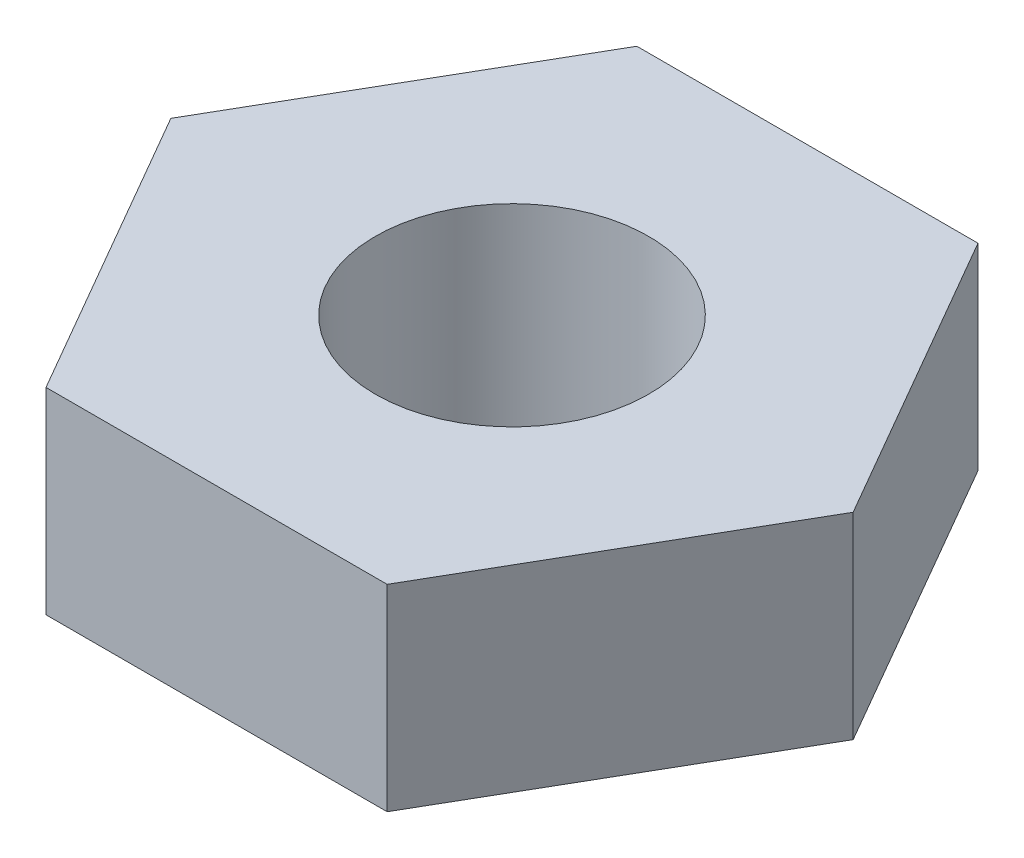
ISO-10303-21;
HEADER;
FILE_DESCRIPTION(('STEP AP214'),'2;1');
FILE_NAME('part.step','',(''),(''),'','','');
FILE_SCHEMA(('AUTOMOTIVE_DESIGN { 1 0 10303 214 1 1 1 1 }'));
ENDSEC;
DATA;
#1=APPLICATION_CONTEXT('core data for automotive mechanical design processes');
#2=APPLICATION_PROTOCOL_DEFINITION('international standard','automotive_design',2000,#1);
#3=PRODUCT_CONTEXT('',#1,'mechanical');
#4=PRODUCT('Part','Part','',(#3));
#5=PRODUCT_RELATED_PRODUCT_CATEGORY('part','',(#4));
#6=PRODUCT_DEFINITION_FORMATION('','',#4);
#7=PRODUCT_DEFINITION_CONTEXT('part definition',#1,'design');
#8=PRODUCT_DEFINITION('design','',#6,#7);
#9=PRODUCT_DEFINITION_SHAPE('','',#8);
#10=(LENGTH_UNIT() NAMED_UNIT(*) SI_UNIT(.MILLI.,.METRE.));
#11=(NAMED_UNIT(*) PLANE_ANGLE_UNIT() SI_UNIT($,.RADIAN.));
#12=(NAMED_UNIT(*) SI_UNIT($,.STERADIAN.) SOLID_ANGLE_UNIT());
#13=UNCERTAINTY_MEASURE_WITH_UNIT(LENGTH_MEASURE(1.E-05),#10,'distance_accuracy_value','');
#14=(GEOMETRIC_REPRESENTATION_CONTEXT(3) GLOBAL_UNCERTAINTY_ASSIGNED_CONTEXT((#13)) GLOBAL_UNIT_ASSIGNED_CONTEXT((#10,
#11,#12)) REPRESENTATION_CONTEXT('',''));
#15=CARTESIAN_POINT('',(0.,0.,0.));
#16=DIRECTION('',(0.,0.,1.));
#17=DIRECTION('',(1.,0.,0.));
#18=AXIS2_PLACEMENT_3D('',#15,#16,#17);
#19=CARTESIAN_POINT('',(0.,3.,0.));
#20=DIRECTION('',(0.,1.,0.));
#21=DIRECTION('',(0.,0.,1.));
#22=AXIS2_PLACEMENT_3D('',#19,#20,#21);
#23=PLANE('',#22);
#24=DIRECTION('',(0.5,0.,-0.866025403784439));
#25=VECTOR('',#24,1.);
#26=CARTESIAN_POINT('',(2.59807621135332,3.,4.5));
#27=LINE('',#26,#25);
#28=CARTESIAN_POINT('',(2.59807621135332,3.,4.5));
#29=VERTEX_POINT('',#28);
#30=CARTESIAN_POINT('',(5.19615242270663,3.,0.));
#31=VERTEX_POINT('',#30);
#32=EDGE_CURVE('E129',#29,#31,#27,.T.);
#33=ORIENTED_EDGE('',*,*,#32,.T.);
#34=DIRECTION('',(-0.5,0.,-0.866025403784439));
#35=VECTOR('',#34,1.);
#36=CARTESIAN_POINT('',(5.19615242270663,3.,0.));
#37=LINE('',#36,#35);
#38=CARTESIAN_POINT('',(2.59807621135332,3.,-4.5));
#39=VERTEX_POINT('',#38);
#40=EDGE_CURVE('E87',#31,#39,#37,.T.);
#41=ORIENTED_EDGE('',*,*,#40,.T.);
#42=DIRECTION('',(-1.,0.,0.));
#43=VECTOR('',#42,1.);
#44=CARTESIAN_POINT('',(2.59807621135332,3.,-4.5));
#45=LINE('',#44,#43);
#46=CARTESIAN_POINT('',(-2.59807621135332,3.,-4.5));
#47=VERTEX_POINT('',#46);
#48=EDGE_CURVE('E100',#39,#47,#45,.T.);
#49=ORIENTED_EDGE('',*,*,#48,.T.);
#50=DIRECTION('',(-0.5,0.,0.866025403784439));
#51=VECTOR('',#50,1.);
#52=CARTESIAN_POINT('',(-2.59807621135332,3.,-4.5));
#53=LINE('',#52,#51);
#54=CARTESIAN_POINT('',(-5.19615242270663,3.,0.));
#55=VERTEX_POINT('',#54);
#56=EDGE_CURVE('E94',#47,#55,#53,.T.);
#57=ORIENTED_EDGE('',*,*,#56,.T.);
#58=DIRECTION('',(0.5,0.,0.866025403784439));
#59=VECTOR('',#58,1.);
#60=CARTESIAN_POINT('',(-5.19615242270663,3.,0.));
#61=LINE('',#60,#59);
#62=CARTESIAN_POINT('',(-2.59807621135332,3.,4.5));
#63=VERTEX_POINT('',#62);
#64=EDGE_CURVE('E98',#55,#63,#61,.T.);
#65=ORIENTED_EDGE('',*,*,#64,.T.);
#66=DIRECTION('',(1.,0.,0.));
#67=VECTOR('',#66,1.);
#68=CARTESIAN_POINT('',(-2.59807621135332,3.,4.5));
#69=LINE('',#68,#67);
#70=EDGE_CURVE('E50',#63,#29,#69,.T.);
#71=ORIENTED_EDGE('',*,*,#70,.T.);
#72=EDGE_LOOP('',(#33,#41,#49,#57,#65,#71));
#73=FACE_BOUND('',#72,.T.);
#74=CARTESIAN_POINT('',(0.,3.,0.));
#75=DIRECTION('',(0.,1.,0.));
#76=DIRECTION('',(0.,0.,1.));
#77=AXIS2_PLACEMENT_3D('',#74,#75,#76);
#78=CIRCLE('',#77,2.0828);
#79=CARTESIAN_POINT('',(0.,3.,2.0828));
#80=VERTEX_POINT('',#79);
#81=EDGE_CURVE('E122',#80,#80,#78,.T.);
#82=ORIENTED_EDGE('',*,*,#81,.F.);
#83=EDGE_LOOP('',(#82));
#84=FACE_BOUND('',#83,.T.);
#85=ADVANCED_FACE('F33',(#73,#84),#23,.T.);
#86=CARTESIAN_POINT('',(0.,0.,0.));
#87=DIRECTION('',(0.,1.,0.));
#88=DIRECTION('',(0.,0.,1.));
#89=AXIS2_PLACEMENT_3D('',#86,#87,#88);
#90=PLANE('',#89);
#91=DIRECTION('',(0.5,0.,-0.866025403784439));
#92=VECTOR('',#91,1.);
#93=CARTESIAN_POINT('',(2.59807621135332,0.,4.5));
#94=LINE('',#93,#92);
#95=CARTESIAN_POINT('',(2.59807621135332,0.,4.5));
#96=VERTEX_POINT('',#95);
#97=CARTESIAN_POINT('',(5.19615242270663,0.,0.));
#98=VERTEX_POINT('',#97);
#99=EDGE_CURVE('E118',#96,#98,#94,.T.);
#100=ORIENTED_EDGE('',*,*,#99,.F.);
#101=DIRECTION('',(1.,0.,0.));
#102=VECTOR('',#101,1.);
#103=CARTESIAN_POINT('',(-2.59807621135332,0.,4.5));
#104=LINE('',#103,#102);
#105=CARTESIAN_POINT('',(-2.59807621135332,0.,4.5));
#106=VERTEX_POINT('',#105);
#107=EDGE_CURVE('E79',#106,#96,#104,.T.);
#108=ORIENTED_EDGE('',*,*,#107,.F.);
#109=DIRECTION('',(0.5,0.,0.866025403784439));
#110=VECTOR('',#109,1.);
#111=CARTESIAN_POINT('',(-5.19615242270663,0.,0.));
#112=LINE('',#111,#110);
#113=CARTESIAN_POINT('',(-5.19615242270663,0.,0.));
#114=VERTEX_POINT('',#113);
#115=EDGE_CURVE('E73',#114,#106,#112,.T.);
#116=ORIENTED_EDGE('',*,*,#115,.F.);
#117=DIRECTION('',(-0.5,0.,0.866025403784439));
#118=VECTOR('',#117,1.);
#119=CARTESIAN_POINT('',(-2.59807621135332,0.,-4.5));
#120=LINE('',#119,#118);
#121=CARTESIAN_POINT('',(-2.59807621135332,0.,-4.5));
#122=VERTEX_POINT('',#121);
#123=EDGE_CURVE('E108',#122,#114,#120,.T.);
#124=ORIENTED_EDGE('',*,*,#123,.F.);
#125=DIRECTION('',(-1.,0.,0.));
#126=VECTOR('',#125,1.);
#127=CARTESIAN_POINT('',(2.59807621135332,0.,-4.5));
#128=LINE('',#127,#126);
#129=CARTESIAN_POINT('',(2.59807621135332,0.,-4.5));
#130=VERTEX_POINT('',#129);
#131=EDGE_CURVE('E124',#130,#122,#128,.T.);
#132=ORIENTED_EDGE('',*,*,#131,.F.);
#133=DIRECTION('',(-0.5,0.,-0.866025403784439));
#134=VECTOR('',#133,1.);
#135=CARTESIAN_POINT('',(5.19615242270663,0.,0.));
#136=LINE('',#135,#134);
#137=EDGE_CURVE('E121',#98,#130,#136,.T.);
#138=ORIENTED_EDGE('',*,*,#137,.F.);
#139=EDGE_LOOP('',(#100,#108,#116,#124,#132,#138));
#140=FACE_BOUND('',#139,.T.);
#141=CARTESIAN_POINT('',(0.,0.,0.));
#142=DIRECTION('',(0.,1.,0.));
#143=DIRECTION('',(0.,0.,1.));
#144=AXIS2_PLACEMENT_3D('',#141,#142,#143);
#145=CIRCLE('',#144,2.0828);
#146=CARTESIAN_POINT('',(0.,0.,2.0828));
#147=VERTEX_POINT('',#146);
#148=EDGE_CURVE('E222',#147,#147,#145,.T.);
#149=ORIENTED_EDGE('',*,*,#148,.T.);
#150=EDGE_LOOP('',(#149));
#151=FACE_BOUND('',#150,.T.);
#152=ADVANCED_FACE('F138',(#140,#151),#90,.F.);
#153=CARTESIAN_POINT('',(2.59807621135332,3.,4.5));
#154=DIRECTION('',(-0.866025403784439,0.,-0.5));
#155=DIRECTION('',(-0.5,0.,0.866025403784439));
#156=AXIS2_PLACEMENT_3D('',#153,#154,#155);
#157=PLANE('',#156);
#158=ORIENTED_EDGE('',*,*,#99,.T.);
#159=DIRECTION('',(0.,-1.,0.));
#160=VECTOR('',#159,1.);
#161=CARTESIAN_POINT('',(5.19615242270663,3.,0.));
#162=LINE('',#161,#160);
#163=EDGE_CURVE('E11',#31,#98,#162,.T.);
#164=ORIENTED_EDGE('',*,*,#163,.F.);
#165=ORIENTED_EDGE('',*,*,#32,.F.);
#166=DIRECTION('',(0.,-1.,0.));
#167=VECTOR('',#166,1.);
#168=CARTESIAN_POINT('',(2.59807621135332,3.,4.5));
#169=LINE('',#168,#167);
#170=EDGE_CURVE('E114',#29,#96,#169,.T.);
#171=ORIENTED_EDGE('',*,*,#170,.T.);
#172=EDGE_LOOP('',(#158,#164,#165,#171));
#173=FACE_BOUND('',#172,.T.);
#174=ADVANCED_FACE('F35',(#173),#157,.F.);
#175=CARTESIAN_POINT('',(5.19615242270663,3.,0.));
#176=DIRECTION('',(-0.866025403784439,0.,0.5));
#177=DIRECTION('',(0.5,0.,0.866025403784439));
#178=AXIS2_PLACEMENT_3D('',#175,#176,#177);
#179=PLANE('',#178);
#180=ORIENTED_EDGE('',*,*,#137,.T.);
#181=DIRECTION('',(0.,-1.,0.));
#182=VECTOR('',#181,1.);
#183=CARTESIAN_POINT('',(2.59807621135332,3.,-4.5));
#184=LINE('',#183,#182);
#185=EDGE_CURVE('E42',#39,#130,#184,.T.);
#186=ORIENTED_EDGE('',*,*,#185,.F.);
#187=ORIENTED_EDGE('',*,*,#40,.F.);
#188=ORIENTED_EDGE('',*,*,#163,.T.);
#189=EDGE_LOOP('',(#180,#186,#187,#188));
#190=FACE_BOUND('',#189,.T.);
#191=ADVANCED_FACE('F163',(#190),#179,.F.);
#192=CARTESIAN_POINT('',(2.59807621135332,3.,-4.5));
#193=DIRECTION('',(0.,0.,1.));
#194=DIRECTION('',(1.,0.,0.));
#195=AXIS2_PLACEMENT_3D('',#192,#193,#194);
#196=PLANE('',#195);
#197=ORIENTED_EDGE('',*,*,#131,.T.);
#198=DIRECTION('',(0.,-1.,0.));
#199=VECTOR('',#198,1.);
#200=CARTESIAN_POINT('',(-2.59807621135332,3.,-4.5));
#201=LINE('',#200,#199);
#202=EDGE_CURVE('E109',#47,#122,#201,.T.);
#203=ORIENTED_EDGE('',*,*,#202,.F.);
#204=ORIENTED_EDGE('',*,*,#48,.F.);
#205=ORIENTED_EDGE('',*,*,#185,.T.);
#206=EDGE_LOOP('',(#197,#203,#204,#205));
#207=FACE_BOUND('',#206,.T.);
#208=ADVANCED_FACE('F135',(#207),#196,.F.);
#209=CARTESIAN_POINT('',(-2.59807621135332,3.,-4.5));
#210=DIRECTION('',(0.866025403784439,0.,0.5));
#211=DIRECTION('',(0.5,0.,-0.866025403784439));
#212=AXIS2_PLACEMENT_3D('',#209,#210,#211);
#213=PLANE('',#212);
#214=ORIENTED_EDGE('',*,*,#123,.T.);
#215=DIRECTION('',(0.,-1.,0.));
#216=VECTOR('',#215,1.);
#217=CARTESIAN_POINT('',(-5.19615242270663,3.,0.));
#218=LINE('',#217,#216);
#219=EDGE_CURVE('E105',#55,#114,#218,.T.);
#220=ORIENTED_EDGE('',*,*,#219,.F.);
#221=ORIENTED_EDGE('',*,*,#56,.F.);
#222=ORIENTED_EDGE('',*,*,#202,.T.);
#223=EDGE_LOOP('',(#214,#220,#221,#222));
#224=FACE_BOUND('',#223,.T.);
#225=ADVANCED_FACE('F106',(#224),#213,.F.);
#226=CARTESIAN_POINT('',(-5.19615242270663,3.,0.));
#227=DIRECTION('',(0.866025403784439,0.,-0.5));
#228=DIRECTION('',(-0.5,0.,-0.866025403784439));
#229=AXIS2_PLACEMENT_3D('',#226,#227,#228);
#230=PLANE('',#229);
#231=ORIENTED_EDGE('',*,*,#115,.T.);
#232=DIRECTION('',(0.,-1.,0.));
#233=VECTOR('',#232,1.);
#234=CARTESIAN_POINT('',(-2.59807621135332,3.,4.5));
#235=LINE('',#234,#233);
#236=EDGE_CURVE('E110',#63,#106,#235,.T.);
#237=ORIENTED_EDGE('',*,*,#236,.F.);
#238=ORIENTED_EDGE('',*,*,#64,.F.);
#239=ORIENTED_EDGE('',*,*,#219,.T.);
#240=EDGE_LOOP('',(#231,#237,#238,#239));
#241=FACE_BOUND('',#240,.T.);
#242=ADVANCED_FACE('F112',(#241),#230,.F.);
#243=CARTESIAN_POINT('',(-2.59807621135332,3.,4.5));
#244=DIRECTION('',(0.,0.,-1.));
#245=DIRECTION('',(-1.,0.,0.));
#246=AXIS2_PLACEMENT_3D('',#243,#244,#245);
#247=PLANE('',#246);
#248=ORIENTED_EDGE('',*,*,#107,.T.);
#249=ORIENTED_EDGE('',*,*,#170,.F.);
#250=ORIENTED_EDGE('',*,*,#70,.F.);
#251=ORIENTED_EDGE('',*,*,#236,.T.);
#252=EDGE_LOOP('',(#248,#249,#250,#251));
#253=FACE_BOUND('',#252,.T.);
#254=ADVANCED_FACE('F143',(#253),#247,.F.);
#255=CARTESIAN_POINT('',(0.,3.,0.));
#256=DIRECTION('',(0.,-1.,0.));
#257=DIRECTION('',(0.,0.,-1.));
#258=AXIS2_PLACEMENT_3D('',#255,#256,#257);
#259=CYLINDRICAL_SURFACE('',#258,2.0828);
#260=ORIENTED_EDGE('',*,*,#81,.T.);
#261=EDGE_LOOP('',(#260));
#262=FACE_BOUND('',#261,.T.);
#263=ORIENTED_EDGE('',*,*,#148,.F.);
#264=EDGE_LOOP('',(#263));
#265=FACE_BOUND('',#264,.T.);
#266=ADVANCED_FACE('F145',(#262,#265),#259,.F.);
#267=CLOSED_SHELL('',(#85,#152,#174,#191,#208,#225,#242,#254,#266));
#268=MANIFOLD_SOLID_BREP('B2',#267);
#269=ADVANCED_BREP_SHAPE_REPRESENTATION('',(#18,#268),#14);
#270=SHAPE_DEFINITION_REPRESENTATION(#9,#269);
ENDSEC;
END-ISO-10303-21;
